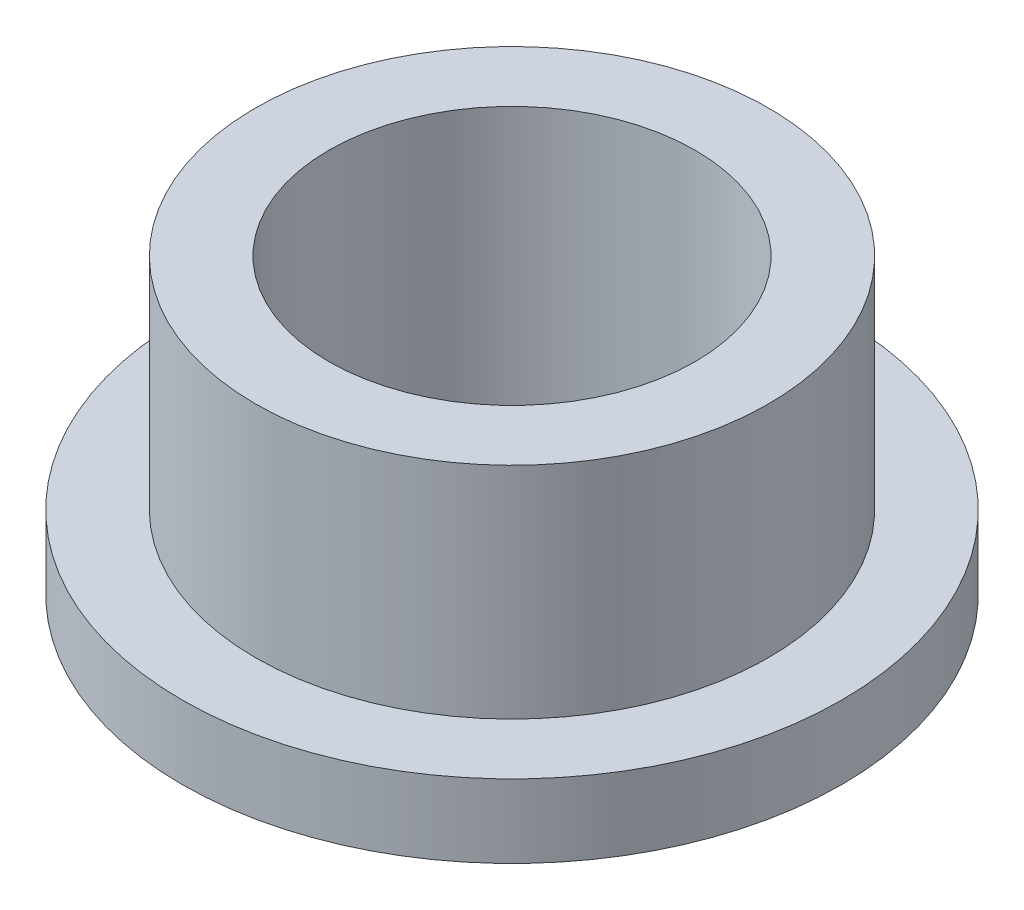
ISO-10303-21;
HEADER;
FILE_DESCRIPTION(('STEP AP214'),'2;1');
FILE_NAME('part.step','',(''),(''),'','','');
FILE_SCHEMA(('AUTOMOTIVE_DESIGN { 1 0 10303 214 1 1 1 1 }'));
ENDSEC;
DATA;
#1=APPLICATION_CONTEXT('core data for automotive mechanical design processes');
#2=APPLICATION_PROTOCOL_DEFINITION('international standard','automotive_design',2000,#1);
#3=PRODUCT_CONTEXT('',#1,'mechanical');
#4=PRODUCT('Part','Part','',(#3));
#5=PRODUCT_RELATED_PRODUCT_CATEGORY('part','',(#4));
#6=PRODUCT_DEFINITION_FORMATION('','',#4);
#7=PRODUCT_DEFINITION_CONTEXT('part definition',#1,'design');
#8=PRODUCT_DEFINITION('design','',#6,#7);
#9=PRODUCT_DEFINITION_SHAPE('','',#8);
#10=(LENGTH_UNIT() NAMED_UNIT(*) SI_UNIT(.MILLI.,.METRE.));
#11=(NAMED_UNIT(*) PLANE_ANGLE_UNIT() SI_UNIT($,.RADIAN.));
#12=(NAMED_UNIT(*) SI_UNIT($,.STERADIAN.) SOLID_ANGLE_UNIT());
#13=UNCERTAINTY_MEASURE_WITH_UNIT(LENGTH_MEASURE(1.E-05),#10,'distance_accuracy_value','');
#14=(GEOMETRIC_REPRESENTATION_CONTEXT(3) GLOBAL_UNCERTAINTY_ASSIGNED_CONTEXT((#13)) GLOBAL_UNIT_ASSIGNED_CONTEXT((#10,
#11,#12)) REPRESENTATION_CONTEXT('',''));
#15=CARTESIAN_POINT('',(0.,0.,0.));
#16=DIRECTION('',(0.,0.,1.));
#17=DIRECTION('',(1.,0.,0.));
#18=AXIS2_PLACEMENT_3D('',#15,#16,#17);
#19=CARTESIAN_POINT('',(0.,2.,0.));
#20=DIRECTION('',(0.,1.,0.));
#21=DIRECTION('',(0.,0.,1.));
#22=AXIS2_PLACEMENT_3D('',#19,#20,#21);
#23=PLANE('',#22);
#24=CARTESIAN_POINT('',(0.,2.,0.));
#25=DIRECTION('',(0.,1.,0.));
#26=DIRECTION('',(0.,0.,1.));
#27=AXIS2_PLACEMENT_3D('',#24,#25,#26);
#28=CIRCLE('',#27,9.);
#29=CARTESIAN_POINT('',(0.,2.,9.));
#30=VERTEX_POINT('',#29);
#31=EDGE_CURVE('E10',#30,#30,#28,.T.);
#32=ORIENTED_EDGE('',*,*,#31,.T.);
#33=EDGE_LOOP('',(#32));
#34=FACE_BOUND('',#33,.T.);
#35=CARTESIAN_POINT('',(0.,2.,0.));
#36=DIRECTION('',(0.,1.,0.));
#37=DIRECTION('',(0.,0.,1.));
#38=AXIS2_PLACEMENT_3D('',#35,#36,#37);
#39=CIRCLE('',#38,7.);
#40=CARTESIAN_POINT('',(0.,2.,7.));
#41=VERTEX_POINT('',#40);
#42=EDGE_CURVE('E46',#41,#41,#39,.T.);
#43=ORIENTED_EDGE('',*,*,#42,.F.);
#44=EDGE_LOOP('',(#43));
#45=FACE_BOUND('',#44,.T.);
#46=ADVANCED_FACE('F30',(#34,#45),#23,.T.);
#47=CARTESIAN_POINT('',(0.,0.,0.));
#48=DIRECTION('',(0.,1.,0.));
#49=DIRECTION('',(0.,0.,1.));
#50=AXIS2_PLACEMENT_3D('',#47,#48,#49);
#51=PLANE('',#50);
#52=CARTESIAN_POINT('',(0.,0.,0.));
#53=DIRECTION('',(0.,1.,0.));
#54=DIRECTION('',(0.,0.,1.));
#55=AXIS2_PLACEMENT_3D('',#52,#53,#54);
#56=CIRCLE('',#55,9.);
#57=CARTESIAN_POINT('',(0.,0.,9.));
#58=VERTEX_POINT('',#57);
#59=EDGE_CURVE('E34',#58,#58,#56,.T.);
#60=ORIENTED_EDGE('',*,*,#59,.F.);
#61=EDGE_LOOP('',(#60));
#62=FACE_BOUND('',#61,.T.);
#63=CARTESIAN_POINT('',(0.,0.,0.));
#64=DIRECTION('',(0.,1.,0.));
#65=DIRECTION('',(0.,0.,1.));
#66=AXIS2_PLACEMENT_3D('',#63,#64,#65);
#67=CIRCLE('',#66,5.);
#68=CARTESIAN_POINT('',(0.,0.,5.));
#69=VERTEX_POINT('',#68);
#70=EDGE_CURVE('E41',#69,#69,#67,.T.);
#71=ORIENTED_EDGE('',*,*,#70,.T.);
#72=EDGE_LOOP('',(#71));
#73=FACE_BOUND('',#72,.T.);
#74=ADVANCED_FACE('F71',(#62,#73),#51,.F.);
#75=CARTESIAN_POINT('',(0.,2.,0.));
#76=DIRECTION('',(0.,-1.,0.));
#77=DIRECTION('',(0.,0.,-1.));
#78=AXIS2_PLACEMENT_3D('',#75,#76,#77);
#79=CYLINDRICAL_SURFACE('',#78,9.);
#80=ORIENTED_EDGE('',*,*,#31,.F.);
#81=EDGE_LOOP('',(#80));
#82=FACE_BOUND('',#81,.T.);
#83=ORIENTED_EDGE('',*,*,#59,.T.);
#84=EDGE_LOOP('',(#83));
#85=FACE_BOUND('',#84,.T.);
#86=ADVANCED_FACE('F32',(#82,#85),#79,.T.);
#87=CARTESIAN_POINT('',(0.,2.,0.));
#88=DIRECTION('',(0.,-1.,0.));
#89=DIRECTION('',(0.,0.,-1.));
#90=AXIS2_PLACEMENT_3D('',#87,#88,#89);
#91=CYLINDRICAL_SURFACE('',#90,5.);
#92=ORIENTED_EDGE('',*,*,#70,.F.);
#93=EDGE_LOOP('',(#92));
#94=FACE_BOUND('',#93,.T.);
#95=CARTESIAN_POINT('',(0.,8.,0.));
#96=DIRECTION('',(0.,1.,0.));
#97=DIRECTION('',(0.,0.,1.));
#98=AXIS2_PLACEMENT_3D('',#95,#96,#97);
#99=CIRCLE('',#98,5.);
#100=CARTESIAN_POINT('',(0.,8.,5.));
#101=VERTEX_POINT('',#100);
#102=EDGE_CURVE('E49',#101,#101,#99,.T.);
#103=ORIENTED_EDGE('',*,*,#102,.T.);
#104=EDGE_LOOP('',(#103));
#105=FACE_BOUND('',#104,.T.);
#106=ADVANCED_FACE('F55',(#94,#105),#91,.F.);
#107=CARTESIAN_POINT('',(0.,8.,0.));
#108=DIRECTION('',(0.,1.,0.));
#109=DIRECTION('',(0.,0.,1.));
#110=AXIS2_PLACEMENT_3D('',#107,#108,#109);
#111=PLANE('',#110);
#112=CARTESIAN_POINT('',(0.,8.,0.));
#113=DIRECTION('',(0.,1.,0.));
#114=DIRECTION('',(0.,0.,1.));
#115=AXIS2_PLACEMENT_3D('',#112,#113,#114);
#116=CIRCLE('',#115,7.);
#117=CARTESIAN_POINT('',(0.,8.,7.));
#118=VERTEX_POINT('',#117);
#119=EDGE_CURVE('E45',#118,#118,#116,.T.);
#120=ORIENTED_EDGE('',*,*,#119,.T.);
#121=EDGE_LOOP('',(#120));
#122=FACE_BOUND('',#121,.T.);
#123=ORIENTED_EDGE('',*,*,#102,.F.);
#124=EDGE_LOOP('',(#123));
#125=FACE_BOUND('',#124,.T.);
#126=ADVANCED_FACE('F57',(#122,#125),#111,.T.);
#127=CARTESIAN_POINT('',(0.,8.,0.));
#128=DIRECTION('',(0.,-1.,0.));
#129=DIRECTION('',(0.,0.,-1.));
#130=AXIS2_PLACEMENT_3D('',#127,#128,#129);
#131=CYLINDRICAL_SURFACE('',#130,7.);
#132=ORIENTED_EDGE('',*,*,#119,.F.);
#133=EDGE_LOOP('',(#132));
#134=FACE_BOUND('',#133,.T.);
#135=ORIENTED_EDGE('',*,*,#42,.T.);
#136=EDGE_LOOP('',(#135));
#137=FACE_BOUND('',#136,.T.);
#138=ADVANCED_FACE('F59',(#134,#137),#131,.T.);
#139=CLOSED_SHELL('',(#46,#74,#86,#106,#126,#138));
#140=MANIFOLD_SOLID_BREP('B2',#139);
#141=ADVANCED_BREP_SHAPE_REPRESENTATION('',(#18,#140),#14);
#142=SHAPE_DEFINITION_REPRESENTATION(#9,#141);
ENDSEC;
END-ISO-10303-21;
